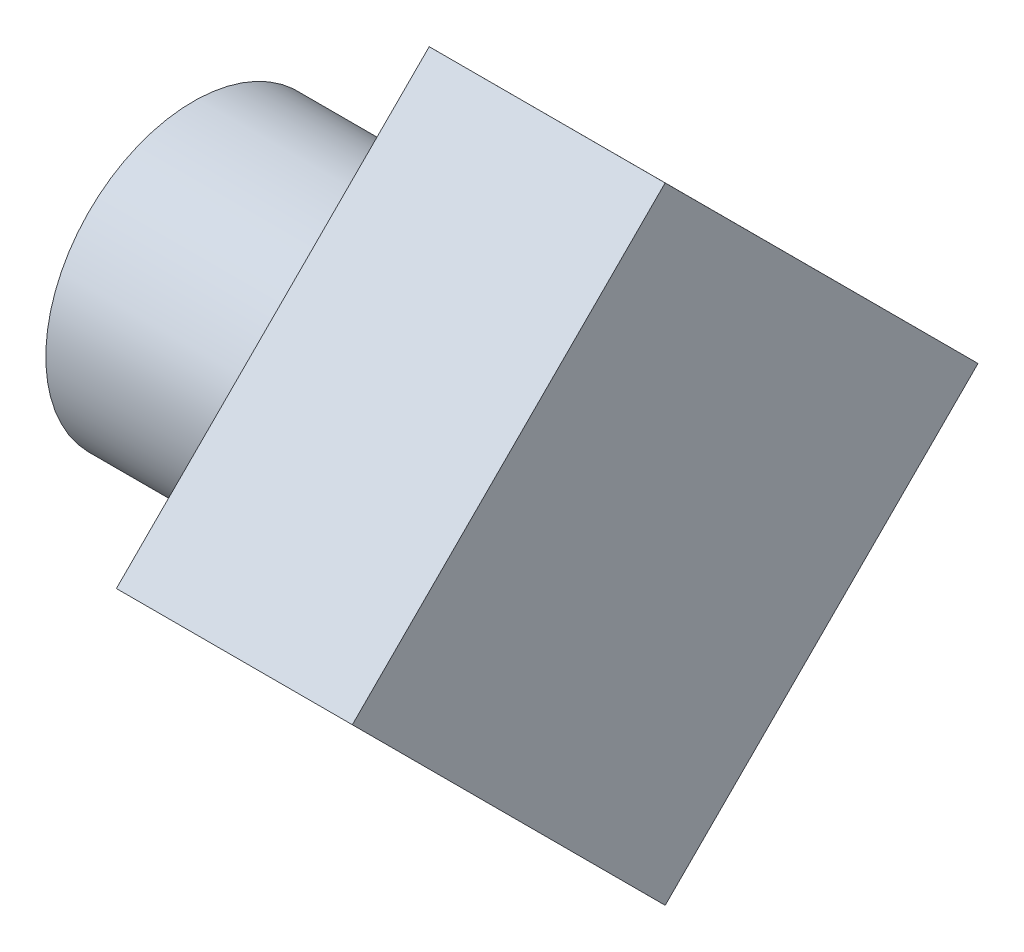
ISO-10303-21;
HEADER;
FILE_DESCRIPTION(('STEP AP214'),'2;1');
FILE_NAME('part.step','',(''),(''),'','','');
FILE_SCHEMA(('AUTOMOTIVE_DESIGN { 1 0 10303 214 1 1 1 1 }'));
ENDSEC;
DATA;
#1=APPLICATION_CONTEXT('core data for automotive mechanical design processes');
#2=APPLICATION_PROTOCOL_DEFINITION('international standard','automotive_design',2000,#1);
#3=PRODUCT_CONTEXT('',#1,'mechanical');
#4=PRODUCT('Part','Part','',(#3));
#5=PRODUCT_RELATED_PRODUCT_CATEGORY('part','',(#4));
#6=PRODUCT_DEFINITION_FORMATION('','',#4);
#7=PRODUCT_DEFINITION_CONTEXT('part definition',#1,'design');
#8=PRODUCT_DEFINITION('design','',#6,#7);
#9=PRODUCT_DEFINITION_SHAPE('','',#8);
#10=(LENGTH_UNIT() NAMED_UNIT(*) SI_UNIT(.MILLI.,.METRE.));
#11=(NAMED_UNIT(*) PLANE_ANGLE_UNIT() SI_UNIT($,.RADIAN.));
#12=(NAMED_UNIT(*) SI_UNIT($,.STERADIAN.) SOLID_ANGLE_UNIT());
#13=UNCERTAINTY_MEASURE_WITH_UNIT(LENGTH_MEASURE(1.E-05),#10,'distance_accuracy_value','');
#14=(GEOMETRIC_REPRESENTATION_CONTEXT(3) GLOBAL_UNCERTAINTY_ASSIGNED_CONTEXT((#13)) GLOBAL_UNIT_ASSIGNED_CONTEXT((#10,
#11,#12)) REPRESENTATION_CONTEXT('',''));
#15=CARTESIAN_POINT('',(0.,0.,0.));
#16=DIRECTION('',(0.,0.,1.));
#17=DIRECTION('',(1.,0.,0.));
#18=AXIS2_PLACEMENT_3D('',#15,#16,#17);
#19=CARTESIAN_POINT('',(54.202624460435,230.493086880873,-114.359972931012));
#20=DIRECTION('',(0.,-0.707051714998213,-0.707161843086917));
#21=DIRECTION('',(0.,0.707161843086917,-0.707051714998213));
#22=AXIS2_PLACEMENT_3D('',#19,#20,#21);
#23=PLANE('',#22);
#24=DIRECTION('',(0.,-0.707161843086917,0.707051714998213));
#25=VECTOR('',#24,1.);
#26=CARTESIAN_POINT('',(48.202624460435,230.493086880873,-114.359972931012));
#27=LINE('',#26,#25);
#28=CARTESIAN_POINT('',(48.202624460435,264.902250761783,-148.763778186468));
#29=VERTEX_POINT('',#28);
#30=CARTESIAN_POINT('',(48.202624460435,256.946680027056,-140.809446392739));
#31=VERTEX_POINT('',#30);
#32=EDGE_CURVE('E100',#29,#31,#27,.T.);
#33=ORIENTED_EDGE('',*,*,#32,.F.);
#34=DIRECTION('',(-1.,0.,0.));
#35=VECTOR('',#34,1.);
#36=CARTESIAN_POINT('',(54.202624460435,264.902250761783,-148.763778186468));
#37=LINE('',#36,#35);
#38=CARTESIAN_POINT('',(54.202624460435,264.902250761783,-148.763778186468));
#39=VERTEX_POINT('',#38);
#40=EDGE_CURVE('E11',#39,#29,#37,.T.);
#41=ORIENTED_EDGE('',*,*,#40,.F.);
#42=DIRECTION('',(0.,-0.707161843086917,0.707051714998213));
#43=VECTOR('',#42,1.);
#44=CARTESIAN_POINT('',(54.202624460435,230.493086880873,-114.359972931012));
#45=LINE('',#44,#43);
#46=CARTESIAN_POINT('',(54.202624460435,256.946680027056,-140.809446392739));
#47=VERTEX_POINT('',#46);
#48=EDGE_CURVE('E94',#39,#47,#45,.T.);
#49=ORIENTED_EDGE('',*,*,#48,.T.);
#50=DIRECTION('',(-1.,0.,0.));
#51=VECTOR('',#50,1.);
#52=CARTESIAN_POINT('',(54.202624460435,256.946680027056,-140.809446392739));
#53=LINE('',#52,#51);
#54=EDGE_CURVE('E73',#47,#31,#53,.T.);
#55=ORIENTED_EDGE('',*,*,#54,.T.);
#56=EDGE_LOOP('',(#33,#41,#49,#55));
#57=FACE_BOUND('',#56,.T.);
#58=ADVANCED_FACE('F34',(#57),#23,.T.);
#59=CARTESIAN_POINT('',(54.202624460435,259.575550478502,-154.091308139361));
#60=DIRECTION('',(0.,0.707161843086919,-0.707051714998211));
#61=DIRECTION('',(0.,0.707051714998211,0.707161843086919));
#62=AXIS2_PLACEMENT_3D('',#59,#60,#61);
#63=PLANE('',#62);
#64=DIRECTION('',(0.,-0.707051714998211,-0.707161843086919));
#65=VECTOR('',#64,1.);
#66=CARTESIAN_POINT('',(48.202624460435,259.575550478502,-154.091308139361));
#67=LINE('',#66,#65);
#68=CARTESIAN_POINT('',(48.202624460435,272.856582555513,-140.808207451741));
#69=VERTEX_POINT('',#68);
#70=EDGE_CURVE('E85',#69,#29,#67,.T.);
#71=ORIENTED_EDGE('',*,*,#70,.F.);
#72=DIRECTION('',(-1.,0.,0.));
#73=VECTOR('',#72,1.);
#74=CARTESIAN_POINT('',(54.202624460435,272.856582555513,-140.808207451741));
#75=LINE('',#74,#73);
#76=CARTESIAN_POINT('',(54.202624460435,272.856582555513,-140.808207451741));
#77=VERTEX_POINT('',#76);
#78=EDGE_CURVE('E42',#77,#69,#75,.T.);
#79=ORIENTED_EDGE('',*,*,#78,.F.);
#80=DIRECTION('',(0.,-0.707051714998211,-0.707161843086919));
#81=VECTOR('',#80,1.);
#82=CARTESIAN_POINT('',(54.202624460435,259.575550478502,-154.091308139361));
#83=LINE('',#82,#81);
#84=EDGE_CURVE('E83',#77,#39,#83,.T.);
#85=ORIENTED_EDGE('',*,*,#84,.T.);
#86=ORIENTED_EDGE('',*,*,#40,.T.);
#87=EDGE_LOOP('',(#71,#79,#85,#86));
#88=FACE_BOUND('',#87,.T.);
#89=ADVANCED_FACE('F81',(#88),#63,.T.);
#90=CARTESIAN_POINT('',(54.202624460435,238.447418674603,-106.404402196284));
#91=DIRECTION('',(0.,-0.707051714998213,-0.707161843086917));
#92=DIRECTION('',(0.,0.707161843086917,-0.707051714998213));
#93=AXIS2_PLACEMENT_3D('',#90,#91,#92);
#94=PLANE('',#93);
#95=DIRECTION('',(0.,-0.707161843086917,0.707051714998213));
#96=VECTOR('',#95,1.);
#97=CARTESIAN_POINT('',(48.202624460435,238.447418674603,-106.404402196284));
#98=LINE('',#97,#96);
#99=CARTESIAN_POINT('',(48.202624460435,264.901011820786,-132.853875658011));
#100=VERTEX_POINT('',#99);
#101=EDGE_CURVE('E104',#69,#100,#98,.T.);
#102=ORIENTED_EDGE('',*,*,#101,.T.);
#103=DIRECTION('',(-1.,0.,0.));
#104=VECTOR('',#103,1.);
#105=CARTESIAN_POINT('',(54.202624460435,264.901011820786,-132.853875658011));
#106=LINE('',#105,#104);
#107=CARTESIAN_POINT('',(54.202624460435,264.901011820786,-132.853875658011));
#108=VERTEX_POINT('',#107);
#109=EDGE_CURVE('E88',#108,#100,#106,.T.);
#110=ORIENTED_EDGE('',*,*,#109,.F.);
#111=DIRECTION('',(0.,-0.707161843086917,0.707051714998213));
#112=VECTOR('',#111,1.);
#113=CARTESIAN_POINT('',(54.202624460435,238.447418674603,-106.404402196284));
#114=LINE('',#113,#112);
#115=EDGE_CURVE('E90',#77,#108,#114,.T.);
#116=ORIENTED_EDGE('',*,*,#115,.F.);
#117=ORIENTED_EDGE('',*,*,#78,.T.);
#118=EDGE_LOOP('',(#102,#110,#116,#117));
#119=FACE_BOUND('',#118,.T.);
#120=ADVANCED_FACE('F91',(#119),#94,.F.);
#121=CARTESIAN_POINT('',(54.202624460435,251.619979743774,-146.136976345631));
#122=DIRECTION('',(0.,0.707161843086919,-0.707051714998211));
#123=DIRECTION('',(0.,0.707051714998211,0.707161843086919));
#124=AXIS2_PLACEMENT_3D('',#121,#122,#123);
#125=PLANE('',#124);
#126=DIRECTION('',(0.,-0.707051714998211,-0.707161843086919));
#127=VECTOR('',#126,1.);
#128=CARTESIAN_POINT('',(48.202624460435,251.619979743774,-146.136976345631));
#129=LINE('',#128,#127);
#130=EDGE_CURVE('E66',#100,#31,#129,.T.);
#131=ORIENTED_EDGE('',*,*,#130,.T.);
#132=ORIENTED_EDGE('',*,*,#54,.F.);
#133=DIRECTION('',(0.,-0.707051714998211,-0.707161843086919));
#134=VECTOR('',#133,1.);
#135=CARTESIAN_POINT('',(54.202624460435,251.619979743774,-146.136976345631));
#136=LINE('',#135,#134);
#137=EDGE_CURVE('E50',#108,#47,#136,.T.);
#138=ORIENTED_EDGE('',*,*,#137,.F.);
#139=ORIENTED_EDGE('',*,*,#109,.T.);
#140=EDGE_LOOP('',(#131,#132,#138,#139));
#141=FACE_BOUND('',#140,.T.);
#142=ADVANCED_FACE('F109',(#141),#125,.F.);
#143=CARTESIAN_POINT('',(54.202624460435,225.166386597592,-119.687502883904));
#144=DIRECTION('',(1.,0.,0.));
#145=DIRECTION('',(0.,0.,-1.));
#146=AXIS2_PLACEMENT_3D('',#143,#144,#145);
#147=PLANE('',#146);
#148=ORIENTED_EDGE('',*,*,#48,.F.);
#149=ORIENTED_EDGE('',*,*,#84,.F.);
#150=ORIENTED_EDGE('',*,*,#115,.T.);
#151=ORIENTED_EDGE('',*,*,#137,.T.);
#152=EDGE_LOOP('',(#148,#149,#150,#151));
#153=FACE_BOUND('',#152,.T.);
#154=ADVANCED_FACE('F93',(#153),#147,.T.);
#155=CARTESIAN_POINT('',(48.202624460435,225.166386597592,-119.687502883904));
#156=DIRECTION('',(1.,0.,0.));
#157=DIRECTION('',(0.,0.,-1.));
#158=AXIS2_PLACEMENT_3D('',#155,#156,#157);
#159=PLANE('',#158);
#160=CARTESIAN_POINT('',(48.202624460435,264.901631291284,-140.80882692224));
#161=DIRECTION('',(1.,0.,0.));
#162=DIRECTION('',(0.,0.,-1.));
#163=AXIS2_PLACEMENT_3D('',#160,#161,#162);
#164=CIRCLE('',#163,3.75);
#165=CARTESIAN_POINT('',(48.202624460435,264.901631291284,-144.55882692224));
#166=VERTEX_POINT('',#165);
#167=EDGE_CURVE('E102',#166,#166,#164,.T.);
#168=ORIENTED_EDGE('',*,*,#167,.T.);
#169=EDGE_LOOP('',(#168));
#170=FACE_BOUND('',#169,.T.);
#171=ORIENTED_EDGE('',*,*,#32,.T.);
#172=ORIENTED_EDGE('',*,*,#130,.F.);
#173=ORIENTED_EDGE('',*,*,#101,.F.);
#174=ORIENTED_EDGE('',*,*,#70,.T.);
#175=EDGE_LOOP('',(#171,#172,#173,#174));
#176=FACE_BOUND('',#175,.T.);
#177=ADVANCED_FACE('F110',(#170,#176),#159,.F.);
#178=CARTESIAN_POINT('',(42.202624460435,225.166386597592,-119.687502883904));
#179=DIRECTION('',(1.,0.,0.));
#180=DIRECTION('',(0.,0.,-1.));
#181=AXIS2_PLACEMENT_3D('',#178,#179,#180);
#182=PLANE('',#181);
#183=CARTESIAN_POINT('',(42.202624460435,264.901631291284,-140.80882692224));
#184=DIRECTION('',(1.,0.,0.));
#185=DIRECTION('',(0.,0.,-1.));
#186=AXIS2_PLACEMENT_3D('',#183,#184,#185);
#187=CIRCLE('',#186,3.75);
#188=CARTESIAN_POINT('',(42.202624460435,264.901631291284,-144.55882692224));
#189=VERTEX_POINT('',#188);
#190=EDGE_CURVE('E141',#189,#189,#187,.F.);
#191=ORIENTED_EDGE('',*,*,#190,.T.);
#192=EDGE_LOOP('',(#191));
#193=FACE_BOUND('',#192,.T.);
#194=ADVANCED_FACE('F126',(#193),#182,.F.);
#195=CARTESIAN_POINT('',(31.5960227426368,264.901631291284,-140.80882692224));
#196=DIRECTION('',(1.,0.,0.));
#197=DIRECTION('',(0.,0.,-1.));
#198=AXIS2_PLACEMENT_3D('',#195,#196,#197);
#199=CYLINDRICAL_SURFACE('',#198,3.75);
#200=ORIENTED_EDGE('',*,*,#190,.F.);
#201=EDGE_LOOP('',(#200));
#202=FACE_BOUND('',#201,.T.);
#203=ORIENTED_EDGE('',*,*,#167,.F.);
#204=EDGE_LOOP('',(#203));
#205=FACE_BOUND('',#204,.T.);
#206=ADVANCED_FACE('F130',(#202,#205),#199,.T.);
#207=CLOSED_SHELL('',(#58,#89,#120,#142,#154,#177,#194,#206));
#208=MANIFOLD_SOLID_BREP('B2',#207);
#209=ADVANCED_BREP_SHAPE_REPRESENTATION('',(#18,#208),#14);
#210=SHAPE_DEFINITION_REPRESENTATION(#9,#209);
ENDSEC;
END-ISO-10303-21;
